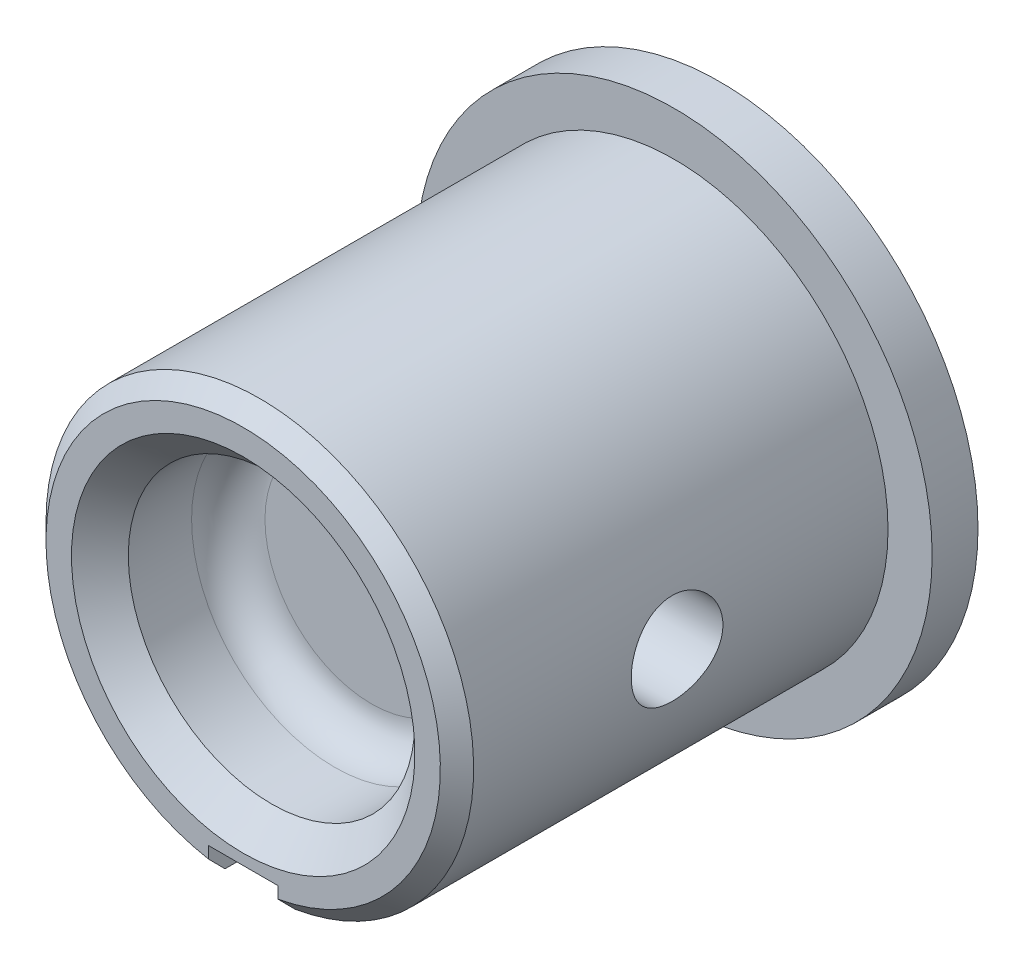
ISO-10303-21;
HEADER;
FILE_DESCRIPTION(('STEP AP214'),'2;1');
FILE_NAME('part.step','',(''),(''),'','','');
FILE_SCHEMA(('AUTOMOTIVE_DESIGN { 1 0 10303 214 1 1 1 1 }'));
ENDSEC;
DATA;
#1=APPLICATION_CONTEXT('core data for automotive mechanical design processes');
#2=APPLICATION_PROTOCOL_DEFINITION('international standard','automotive_design',2000,#1);
#3=PRODUCT_CONTEXT('',#1,'mechanical');
#4=PRODUCT('Part','Part','',(#3));
#5=PRODUCT_RELATED_PRODUCT_CATEGORY('part','',(#4));
#6=PRODUCT_DEFINITION_FORMATION('','',#4);
#7=PRODUCT_DEFINITION_CONTEXT('part definition',#1,'design');
#8=PRODUCT_DEFINITION('design','',#6,#7);
#9=PRODUCT_DEFINITION_SHAPE('','',#8);
#10=(LENGTH_UNIT() NAMED_UNIT(*) SI_UNIT(.MILLI.,.METRE.));
#11=(NAMED_UNIT(*) PLANE_ANGLE_UNIT() SI_UNIT($,.RADIAN.));
#12=(NAMED_UNIT(*) SI_UNIT($,.STERADIAN.) SOLID_ANGLE_UNIT());
#13=UNCERTAINTY_MEASURE_WITH_UNIT(LENGTH_MEASURE(1.E-05),#10,'distance_accuracy_value','');
#14=(GEOMETRIC_REPRESENTATION_CONTEXT(3) GLOBAL_UNCERTAINTY_ASSIGNED_CONTEXT((#13)) GLOBAL_UNIT_ASSIGNED_CONTEXT((#10,
#11,#12)) REPRESENTATION_CONTEXT('',''));
#15=CARTESIAN_POINT('',(0.,0.,0.));
#16=DIRECTION('',(0.,0.,1.));
#17=DIRECTION('',(1.,0.,0.));
#18=AXIS2_PLACEMENT_3D('',#15,#16,#17);
#19=CARTESIAN_POINT('',(0.,0.,8.382));
#20=DIRECTION('',(0.,0.,1.));
#21=DIRECTION('',(1.,0.,0.));
#22=AXIS2_PLACEMENT_3D('',#19,#20,#21);
#23=PLANE('',#22);
#24=CARTESIAN_POINT('',(0.,0.,8.382));
#25=DIRECTION('',(0.,0.,-1.));
#26=DIRECTION('',(1.,0.,0.));
#27=AXIS2_PLACEMENT_3D('',#24,#25,#26);
#28=CIRCLE('',#27,2.95275);
#29=CARTESIAN_POINT('',(2.95275,0.,8.382));
#30=VERTEX_POINT('',#29);
#31=EDGE_CURVE('E104',#30,#30,#28,.F.);
#32=ORIENTED_EDGE('',*,*,#31,.T.);
#33=EDGE_LOOP('',(#32));
#34=FACE_BOUND('',#33,.T.);
#35=ADVANCED_FACE('F16',(#34),#23,.T.);
#36=CARTESIAN_POINT('',(0.,0.,9.398));
#37=DIRECTION('',(0.,0.,-1.));
#38=DIRECTION('',(-1.,0.,0.));
#39=AXIS2_PLACEMENT_3D('',#36,#37,#38);
#40=TOROIDAL_SURFACE('',#39,2.95275,1.016);
#41=CARTESIAN_POINT('',(0.,0.,9.398));
#42=DIRECTION('',(0.,0.,-1.));
#43=DIRECTION('',(-1.,0.,0.));
#44=AXIS2_PLACEMENT_3D('',#41,#42,#43);
#45=CIRCLE('',#44,3.96875);
#46=CARTESIAN_POINT('',(-3.96875,0.,9.398));
#47=VERTEX_POINT('',#46);
#48=EDGE_CURVE('E90',#47,#47,#45,.F.);
#49=ORIENTED_EDGE('',*,*,#48,.T.);
#50=EDGE_LOOP('',(#49));
#51=FACE_BOUND('',#50,.T.);
#52=ORIENTED_EDGE('',*,*,#31,.F.);
#53=EDGE_LOOP('',(#52));
#54=FACE_BOUND('',#53,.T.);
#55=ADVANCED_FACE('F110',(#51,#54),#40,.F.);
#56=CARTESIAN_POINT('',(0.,0.,11.938));
#57=DIRECTION('',(0.,0.,-1.));
#58=DIRECTION('',(-1.,0.,0.));
#59=AXIS2_PLACEMENT_3D('',#56,#57,#58);
#60=CYLINDRICAL_SURFACE('',#59,3.96875);
#61=ORIENTED_EDGE('',*,*,#48,.F.);
#62=EDGE_LOOP('',(#61));
#63=FACE_BOUND('',#62,.T.);
#64=CARTESIAN_POINT('',(0.,0.,11.1506000000645));
#65=DIRECTION('',(0.,0.,1.));
#66=DIRECTION('',(-1.,0.,0.));
#67=AXIS2_PLACEMENT_3D('',#64,#65,#66);
#68=CIRCLE('',#67,3.96875000001273);
#69=CARTESIAN_POINT('',(-3.96875000001273,0.,11.1506000000645));
#70=VERTEX_POINT('',#69);
#71=EDGE_CURVE('E87',#70,#70,#68,.T.);
#72=ORIENTED_EDGE('',*,*,#71,.T.);
#73=EDGE_LOOP('',(#72));
#74=FACE_BOUND('',#73,.T.);
#75=ADVANCED_FACE('F114',(#63,#74),#60,.F.);
#76=CARTESIAN_POINT('',(0.,0.,-1.26999999999999));
#77=DIRECTION('',(0.,0.,-1.));
#78=DIRECTION('',(-1.,0.,0.));
#79=AXIS2_PLACEMENT_3D('',#76,#77,#78);
#80=PLANE('',#79);
#81=CARTESIAN_POINT('',(0.,0.,-1.26999999999999));
#82=DIRECTION('',(0.,0.,-1.));
#83=DIRECTION('',(-1.,0.,0.));
#84=AXIS2_PLACEMENT_3D('',#81,#82,#83);
#85=CIRCLE('',#84,7.14375);
#86=CARTESIAN_POINT('',(-7.14375,0.,-1.26999999999999));
#87=VERTEX_POINT('',#86);
#88=EDGE_CURVE('E191',#87,#87,#85,.F.);
#89=ORIENTED_EDGE('',*,*,#88,.F.);
#90=EDGE_LOOP('',(#89));
#91=FACE_BOUND('',#90,.T.);
#92=ADVANCED_FACE('F240',(#91),#80,.T.);
#93=CARTESIAN_POINT('',(0.,0.,11.9379999999865));
#94=DIRECTION('',(0.,0.,1.));
#95=DIRECTION('',(0.,-1.,0.));
#96=AXIS2_PLACEMENT_3D('',#93,#94,#95);
#97=CONICAL_SURFACE('',#96,4.75614999993468,0.785398163397448);
#98=ORIENTED_EDGE('',*,*,#71,.F.);
#99=EDGE_LOOP('',(#98));
#100=FACE_BOUND('',#99,.T.);
#101=CARTESIAN_POINT('',(0.,0.,11.9379999999865));
#102=DIRECTION('',(0.,0.,1.));
#103=DIRECTION('',(0.,-1.,0.));
#104=AXIS2_PLACEMENT_3D('',#101,#102,#103);
#105=CIRCLE('',#104,4.75614999993468);
#106=CARTESIAN_POINT('',(0.,-4.75614999993468,11.9379999999865));
#107=VERTEX_POINT('',#106);
#108=EDGE_CURVE('E100',#107,#107,#105,.F.);
#109=ORIENTED_EDGE('',*,*,#108,.F.);
#110=EDGE_LOOP('',(#109));
#111=FACE_BOUND('',#110,.T.);
#112=ADVANCED_FACE('F238',(#100,#111),#97,.F.);
#113=CARTESIAN_POINT('',(0.,-5.4864,0.762));
#114=DIRECTION('',(0.,0.,1.));
#115=DIRECTION('',(1.,0.,0.));
#116=AXIS2_PLACEMENT_3D('',#113,#114,#115);
#117=PLANE('',#116);
#118=CARTESIAN_POINT('',(0.,0.,0.762));
#119=DIRECTION('',(0.,0.,-1.));
#120=DIRECTION('',(-1.,0.,0.));
#121=AXIS2_PLACEMENT_3D('',#118,#119,#120);
#122=CIRCLE('',#121,5.92201);
#123=CARTESIAN_POINT('',(-0.965199999999998,-5.84282392342093,0.762));
#124=VERTEX_POINT('',#123);
#125=CARTESIAN_POINT('',(0.965200000000001,-5.84282392342093,0.762));
#126=VERTEX_POINT('',#125);
#127=EDGE_CURVE('E20',#124,#126,#122,.F.);
#128=ORIENTED_EDGE('',*,*,#127,.T.);
#129=DIRECTION('',(0.,1.,0.));
#130=VECTOR('',#129,1.);
#131=CARTESIAN_POINT('',(0.9652,-5.4864,0.762));
#132=LINE('',#131,#130);
#133=CARTESIAN_POINT('',(0.965200000000001,-5.05079,0.762));
#134=VERTEX_POINT('',#133);
#135=EDGE_CURVE('E56',#126,#134,#132,.T.);
#136=ORIENTED_EDGE('',*,*,#135,.T.);
#137=DIRECTION('',(1.,0.,0.));
#138=VECTOR('',#137,1.);
#139=CARTESIAN_POINT('',(-0.9652,-5.05079,0.762000000000001));
#140=LINE('',#139,#138);
#141=CARTESIAN_POINT('',(-0.9652,-5.05079,0.762));
#142=VERTEX_POINT('',#141);
#143=EDGE_CURVE('E85',#134,#142,#140,.F.);
#144=ORIENTED_EDGE('',*,*,#143,.T.);
#145=DIRECTION('',(0.,1.,0.));
#146=VECTOR('',#145,1.);
#147=CARTESIAN_POINT('',(-0.9652,-5.4864,0.762));
#148=LINE('',#147,#146);
#149=EDGE_CURVE('E72',#142,#124,#148,.F.);
#150=ORIENTED_EDGE('',*,*,#149,.T.);
#151=EDGE_LOOP('',(#128,#136,#144,#150));
#152=FACE_BOUND('',#151,.T.);
#153=ADVANCED_FACE('F83',(#152),#117,.T.);
#154=CARTESIAN_POINT('',(0.,0.,-0.634999999999995));
#155=DIRECTION('',(0.,0.,-1.));
#156=DIRECTION('',(-1.,0.,0.));
#157=AXIS2_PLACEMENT_3D('',#154,#155,#156);
#158=CYLINDRICAL_SURFACE('',#157,7.14375);
#159=CARTESIAN_POINT('',(0.,0.,0.));
#160=DIRECTION('',(0.,0.,-1.));
#161=DIRECTION('',(-1.,0.,0.));
#162=AXIS2_PLACEMENT_3D('',#159,#160,#161);
#163=CIRCLE('',#162,7.14375);
#164=CARTESIAN_POINT('',(-7.14375,0.,0.));
#165=VERTEX_POINT('',#164);
#166=EDGE_CURVE('E185',#165,#165,#163,.F.);
#167=ORIENTED_EDGE('',*,*,#166,.F.);
#168=EDGE_LOOP('',(#167));
#169=FACE_BOUND('',#168,.T.);
#170=ORIENTED_EDGE('',*,*,#88,.T.);
#171=EDGE_LOOP('',(#170));
#172=FACE_BOUND('',#171,.T.);
#173=ADVANCED_FACE('F229',(#169,#172),#158,.T.);
#174=CARTESIAN_POINT('',(0.,5.953125,11.938));
#175=DIRECTION('',(0.,0.,1.));
#176=DIRECTION('',(1.,0.,0.));
#177=AXIS2_PLACEMENT_3D('',#174,#175,#176);
#178=PLANE('',#177);
#179=ORIENTED_EDGE('',*,*,#108,.T.);
#180=EDGE_LOOP('',(#179));
#181=FACE_BOUND('',#180,.T.);
#182=DIRECTION('',(0.,1.,0.));
#183=VECTOR('',#182,1.);
#184=CARTESIAN_POINT('',(0.965200000000003,5.953125,11.938));
#185=LINE('',#184,#183);
#186=CARTESIAN_POINT('',(0.965200000000003,-5.05079,11.938));
#187=VERTEX_POINT('',#186);
#188=CARTESIAN_POINT('',(0.965200000000002,-5.37502650786039,11.9379999999932));
#189=VERTEX_POINT('',#188);
#190=EDGE_CURVE('E190',#187,#189,#185,.F.);
#191=ORIENTED_EDGE('',*,*,#190,.T.);
#192=CARTESIAN_POINT('',(0.,0.,11.9379999999865));
#193=DIRECTION('',(0.,0.,-1.));
#194=DIRECTION('',(-1.,0.,0.));
#195=AXIS2_PLACEMENT_3D('',#192,#193,#194);
#196=CIRCLE('',#195,5.46100000002525);
#197=CARTESIAN_POINT('',(-0.9652,-5.37502650786039,11.9379999999932));
#198=VERTEX_POINT('',#197);
#199=EDGE_CURVE('E170',#198,#189,#196,.T.);
#200=ORIENTED_EDGE('',*,*,#199,.F.);
#201=DIRECTION('',(0.,-1.,0.));
#202=VECTOR('',#201,1.);
#203=CARTESIAN_POINT('',(-0.9652,-5.84282392342093,11.938));
#204=LINE('',#203,#202);
#205=CARTESIAN_POINT('',(-0.9652,-5.05079,11.938));
#206=VERTEX_POINT('',#205);
#207=EDGE_CURVE('E188',#198,#206,#204,.F.);
#208=ORIENTED_EDGE('',*,*,#207,.T.);
#209=DIRECTION('',(1.,0.,0.));
#210=VECTOR('',#209,1.);
#211=CARTESIAN_POINT('',(-0.9652,-5.05079,11.938));
#212=LINE('',#211,#210);
#213=EDGE_CURVE('E99',#206,#187,#212,.T.);
#214=ORIENTED_EDGE('',*,*,#213,.T.);
#215=EDGE_LOOP('',(#191,#200,#208,#214));
#216=FACE_BOUND('',#215,.T.);
#217=ADVANCED_FACE('F219',(#181,#216),#178,.T.);
#218=CARTESIAN_POINT('',(-0.9652,-5.05079,11.938));
#219=DIRECTION('',(0.,1.,0.));
#220=DIRECTION('',(0.,0.,1.));
#221=AXIS2_PLACEMENT_3D('',#218,#219,#220);
#222=PLANE('',#221);
#223=DIRECTION('',(0.,0.,1.));
#224=VECTOR('',#223,1.);
#225=CARTESIAN_POINT('',(-0.9652,-5.05079,11.938));
#226=LINE('',#225,#224);
#227=EDGE_CURVE('E184',#206,#142,#226,.F.);
#228=ORIENTED_EDGE('',*,*,#227,.T.);
#229=ORIENTED_EDGE('',*,*,#143,.F.);
#230=DIRECTION('',(0.,0.,1.));
#231=VECTOR('',#230,1.);
#232=CARTESIAN_POINT('',(0.965200000000003,-5.05079,11.938));
#233=LINE('',#232,#231);
#234=EDGE_CURVE('E162',#134,#187,#233,.T.);
#235=ORIENTED_EDGE('',*,*,#234,.T.);
#236=ORIENTED_EDGE('',*,*,#213,.F.);
#237=EDGE_LOOP('',(#228,#229,#235,#236));
#238=FACE_BOUND('',#237,.T.);
#239=ADVANCED_FACE('F221',(#238),#222,.F.);
#240=CARTESIAN_POINT('',(0.,7.14375,0.));
#241=DIRECTION('',(0.,0.,1.));
#242=DIRECTION('',(1.,0.,0.));
#243=AXIS2_PLACEMENT_3D('',#240,#241,#242);
#244=PLANE('',#243);
#245=CARTESIAN_POINT('',(0.,0.,0.));
#246=DIRECTION('',(0.,0.,-1.));
#247=DIRECTION('',(-1.,0.,0.));
#248=AXIS2_PLACEMENT_3D('',#245,#246,#247);
#249=CIRCLE('',#248,5.92201);
#250=CARTESIAN_POINT('',(-5.92201,0.,0.));
#251=VERTEX_POINT('',#250);
#252=EDGE_CURVE('E81',#251,#251,#249,.F.);
#253=ORIENTED_EDGE('',*,*,#252,.F.);
#254=EDGE_LOOP('',(#253));
#255=FACE_BOUND('',#254,.T.);
#256=ORIENTED_EDGE('',*,*,#166,.T.);
#257=EDGE_LOOP('',(#256));
#258=FACE_BOUND('',#257,.T.);
#259=ADVANCED_FACE('F223',(#255,#258),#244,.T.);
#260=CARTESIAN_POINT('',(-0.9652,-5.84282392342093,11.938));
#261=DIRECTION('',(-1.,0.,0.));
#262=DIRECTION('',(0.,-1.,0.));
#263=AXIS2_PLACEMENT_3D('',#260,#261,#262);
#264=PLANE('',#263);
#265=DIRECTION('',(0.,0.,-1.));
#266=VECTOR('',#265,1.);
#267=CARTESIAN_POINT('',(-0.965199999999995,-5.84282392342093,5.969));
#268=LINE('',#267,#266);
#269=CARTESIAN_POINT('',(-0.965199999999998,-5.84282392340875,11.4769900000179));
#270=VERTEX_POINT('',#269);
#271=EDGE_CURVE('E68',#124,#270,#268,.F.);
#272=ORIENTED_EDGE('',*,*,#271,.F.);
#273=ORIENTED_EDGE('',*,*,#149,.F.);
#274=ORIENTED_EDGE('',*,*,#227,.F.);
#275=ORIENTED_EDGE('',*,*,#207,.F.);
#276=CARTESIAN_POINT('',(-0.9652,-5.84282392339656,11.4769900000358));
#277=CARTESIAN_POINT('',(-0.9652,-5.76490383496771,11.5538718263794));
#278=CARTESIAN_POINT('',(-0.9652,-5.6869606729343,11.6307302394076));
#279=CARTESIAN_POINT('',(-0.9652,-5.53102820108882,11.7844002393942));
#280=CARTESIAN_POINT('',(-0.9652,-5.45303889127641,11.8612118263523));
#281=CARTESIAN_POINT('',(-0.9652,-5.3750265078591,11.9379999999945));
#282=B_SPLINE_CURVE_WITH_KNOTS('',3,(#276,#277,#278,#279,#280,#281),.UNSPECIFIED.,.F.,.F.,(4,2,
4),(0.,0.328391792602659,0.656783587604142),.UNSPECIFIED.);
#283=EDGE_CURVE('E79',#270,#198,#282,.T.);
#284=ORIENTED_EDGE('',*,*,#283,.F.);
#285=EDGE_LOOP('',(#272,#273,#274,#275,#284));
#286=FACE_BOUND('',#285,.T.);
#287=ADVANCED_FACE('F75',(#286),#264,.F.);
#288=CARTESIAN_POINT('',(0.,0.,11.4769899999487));
#289=DIRECTION('',(0.,0.,-1.));
#290=DIRECTION('',(-1.,0.,0.));
#291=AXIS2_PLACEMENT_3D('',#288,#289,#290);
#292=CONICAL_SURFACE('',#291,5.92201000006298,0.785398163397448);
#293=CARTESIAN_POINT('',(0.965200000000002,-5.37502650785522,11.9379999999983));
#294=CARTESIAN_POINT('',(0.965200000000002,-5.45303889127521,11.8612118263535));
#295=CARTESIAN_POINT('',(0.965200000000001,-5.5310282010903,11.7844002393927));
#296=CARTESIAN_POINT('',(0.965200000000001,-5.68696067294114,11.6307302394009));
#297=CARTESIAN_POINT('',(0.965200000000001,-5.76490383497723,11.5538718263701));
#298=CARTESIAN_POINT('',(0.9652,-5.84282392340875,11.4769900000237));
#299=B_SPLINE_CURVE_WITH_KNOTS('',3,(#293,#294,#295,#296,#297,#298),.UNSPECIFIED.,.F.,.F.,(4,2,
4),(0.,0.328391795012768,0.656783587626709),.UNSPECIFIED.);
#300=CARTESIAN_POINT('',(0.965200000000002,-5.84282392341484,11.4769900000119));
#301=VERTEX_POINT('',#300);
#302=EDGE_CURVE('E35',#189,#301,#299,.T.);
#303=ORIENTED_EDGE('',*,*,#302,.T.);
#304=CARTESIAN_POINT('',(0.,0.,11.47699));
#305=DIRECTION('',(0.,0.,-1.));
#306=DIRECTION('',(-1.,0.,0.));
#307=AXIS2_PLACEMENT_3D('',#304,#305,#306);
#308=CIRCLE('',#307,5.92201);
#309=EDGE_CURVE('E80',#270,#301,#308,.T.);
#310=ORIENTED_EDGE('',*,*,#309,.F.);
#311=ORIENTED_EDGE('',*,*,#283,.T.);
#312=ORIENTED_EDGE('',*,*,#199,.T.);
#313=EDGE_LOOP('',(#303,#310,#311,#312));
#314=FACE_BOUND('',#313,.T.);
#315=ADVANCED_FACE('F152',(#314),#292,.T.);
#316=CARTESIAN_POINT('',(0.965200000000003,-5.05079,11.938));
#317=DIRECTION('',(1.,0.,0.));
#318=DIRECTION('',(0.,1.,0.));
#319=AXIS2_PLACEMENT_3D('',#316,#317,#318);
#320=PLANE('',#319);
#321=ORIENTED_EDGE('',*,*,#190,.F.);
#322=ORIENTED_EDGE('',*,*,#234,.F.);
#323=ORIENTED_EDGE('',*,*,#135,.F.);
#324=DIRECTION('',(0.,0.,-1.));
#325=VECTOR('',#324,1.);
#326=CARTESIAN_POINT('',(0.965200000000003,-5.84282392342093,5.969));
#327=LINE('',#326,#325);
#328=EDGE_CURVE('E69',#301,#126,#327,.T.);
#329=ORIENTED_EDGE('',*,*,#328,.F.);
#330=ORIENTED_EDGE('',*,*,#302,.F.);
#331=EDGE_LOOP('',(#321,#322,#323,#329,#330));
#332=FACE_BOUND('',#331,.T.);
#333=ADVANCED_FACE('F147',(#332),#320,.F.);
#334=CARTESIAN_POINT('',(0.,0.,5.842));
#335=DIRECTION('',(1.,0.,0.));
#336=DIRECTION('',(0.,0.,-1.));
#337=AXIS2_PLACEMENT_3D('',#334,#335,#336);
#338=CYLINDRICAL_SURFACE('',#337,1.27);
#339=CARTESIAN_POINT('',(5.78422876796034,-1.27,5.842));
#340=CARTESIAN_POINT('',(5.78423019043854,-1.26999753154441,5.91245070838072));
#341=CARTESIAN_POINT('',(5.78552989364852,-1.26411790053725,5.98293141257982));
#342=CARTESIAN_POINT('',(5.79057917663973,-1.24077901258341,6.12189095327402));
#343=CARTESIAN_POINT('',(5.7943305720035,-1.22331117393029,6.19036826687874));
#344=CARTESIAN_POINT('',(5.80383927760964,-1.17736912725354,6.32329075856355));
#345=CARTESIAN_POINT('',(5.80959443490341,-1.14890672879197,6.38774017711405));
#346=CARTESIAN_POINT('',(5.82245961990261,-1.08181697159541,6.51094981315048));
#347=CARTESIAN_POINT('',(5.82956960854718,-1.04318990590358,6.56971019458223));
#348=CARTESIAN_POINT('',(5.84447236616351,-0.956198497594469,6.68082963727089));
#349=CARTESIAN_POINT('',(5.85227358107198,-0.907700352935909,6.73308283498115));
#350=CARTESIAN_POINT('',(5.86760575776913,-0.80263237625998,6.8287781703955));
#351=CARTESIAN_POINT('',(5.87513669901522,-0.746061932313847,6.87221963951254));
#352=CARTESIAN_POINT('',(5.88917156935918,-0.625747449440325,6.94947526697142));
#353=CARTESIAN_POINT('',(5.89566437214772,-0.561936803383417,6.98318788937305));
#354=CARTESIAN_POINT('',(5.90679612290519,-0.429393628697957,7.03937234606026));
#355=CARTESIAN_POINT('',(5.91143527071322,-0.360661631573718,7.06184539212944));
#356=CARTESIAN_POINT('',(5.91827732461187,-0.221327073452878,7.09458060902384));
#357=CARTESIAN_POINT('',(5.92051592380923,-0.150768367063298,7.10502185731505));
#358=CARTESIAN_POINT('',(5.92242822466802,-0.008867647093742,7.11395671127931));
#359=CARTESIAN_POINT('',(5.92210220886384,0.0624742793369878,7.112451633036));
#360=CARTESIAN_POINT('',(5.91894938070722,0.20268273334354,7.09767050837816));
#361=CARTESIAN_POINT('',(5.91616357209747,0.271570664000415,7.08458745408881));
#362=CARTESIAN_POINT('',(5.9084507780475,0.406149950693564,7.04732895961609));
#363=CARTESIAN_POINT('',(5.90352369829368,0.471841165786799,7.02315303083762));
#364=CARTESIAN_POINT('',(5.89201564430516,0.59870151873607,6.96422245140721));
#365=CARTESIAN_POINT('',(5.88542320047035,0.659835323313239,6.92939406999803));
#366=CARTESIAN_POINT('',(5.87130819580074,0.775461384272288,6.85020211284715));
#367=CARTESIAN_POINT('',(5.86378551290536,0.829952767207408,6.80583728522326));
#368=CARTESIAN_POINT('',(5.84846044762657,0.931894431065659,6.70777917393297));
#369=CARTESIAN_POINT('',(5.8406554805794,0.979181983916723,6.6539169774018));
#370=CARTESIAN_POINT('',(5.82578696313064,1.06408267605516,6.53894667757515));
#371=CARTESIAN_POINT('',(5.81872343128937,1.10169557319133,6.47783839297006));
#372=CARTESIAN_POINT('',(5.80613110571408,1.16624772230353,6.34985441621532));
#373=CARTESIAN_POINT('',(5.80060659644426,1.19315726459275,6.28296328953213));
#374=CARTESIAN_POINT('',(5.79177793610174,1.23530533994072,6.145462246658));
#375=CARTESIAN_POINT('',(5.78847344783675,1.25054564545379,6.07485289697442));
#376=CARTESIAN_POINT('',(5.78452746826554,1.2686723986734,5.93340382879526));
#377=CARTESIAN_POINT('',(5.78383500782889,1.27179533072559,5.86259580272412));
#378=CARTESIAN_POINT('',(5.7850541547333,1.26623802655928,5.72147083253194));
#379=CARTESIAN_POINT('',(5.78696559062974,1.25755856742877,5.6511538563858));
#380=CARTESIAN_POINT('',(5.7931291223186,1.2288477376243,5.51382370340442));
#381=CARTESIAN_POINT('',(5.79735453568513,1.2089456980489,5.44678218039867));
#382=CARTESIAN_POINT('',(5.8076460134063,1.15849427403013,5.31698525181255));
#383=CARTESIAN_POINT('',(5.81371224828175,1.12794390316095,5.25423024396496));
#384=CARTESIAN_POINT('',(5.8271144338426,1.05653865754824,5.13376165016051));
#385=CARTESIAN_POINT('',(5.83446789449693,1.01553756325133,5.07613672024115));
#386=CARTESIAN_POINT('',(5.84956937027859,0.924586906015841,4.96849845031591));
#387=CARTESIAN_POINT('',(5.85731743233699,0.874636276896245,4.91848601852086));
#388=CARTESIAN_POINT('',(5.87250250521467,0.766136322872278,4.82657952574814));
#389=CARTESIAN_POINT('',(5.87993149092006,0.707449378607752,4.78484638258287));
#390=CARTESIAN_POINT('',(5.89349567131357,0.583760371144494,4.71183165158195));
#391=CARTESIAN_POINT('',(5.89963092512168,0.518758596714559,4.6805495861225));
#392=CARTESIAN_POINT('',(5.90988242197144,0.384681770381881,4.62955157092733));
#393=CARTESIAN_POINT('',(5.91401113744788,0.315634950410999,4.60976401825449));
#394=CARTESIAN_POINT('',(5.91983819193874,0.17509900142468,4.58209228826361));
#395=CARTESIAN_POINT('',(5.92153686987843,0.103610214422694,4.57420645096603));
#396=CARTESIAN_POINT('',(5.9223028730066,-0.0382505685620238,4.57063421322773));
#397=CARTESIAN_POINT('',(5.92142210418266,-0.108616333110905,4.57470717122595));
#398=CARTESIAN_POINT('',(5.91723889748306,-0.247635611723433,4.59440027603786));
#399=CARTESIAN_POINT('',(5.91393649990504,-0.316289154260025,4.61002023070127));
#400=CARTESIAN_POINT('',(5.90528438236595,-0.44975752265976,4.65225052622921));
#401=CARTESIAN_POINT('',(5.89994079680882,-0.514583184958089,4.67882795527935));
#402=CARTESIAN_POINT('',(5.88777801268395,-0.638887677684315,4.74218619207701));
#403=CARTESIAN_POINT('',(5.88095867694329,-0.698366010343019,4.77896794841973));
#404=CARTESIAN_POINT('',(5.86643341213001,-0.811465136844986,4.86248179900502));
#405=CARTESIAN_POINT('',(5.85871353043912,-0.864958671566012,4.90938382447386));
#406=CARTESIAN_POINT('',(5.84333417709668,-0.963398299582785,5.01146252756262));
#407=CARTESIAN_POINT('',(5.83567472038098,-1.00834233937704,5.06664118746798));
#408=CARTESIAN_POINT('',(5.82117496820221,-1.08895723139193,5.18455200743988));
#409=CARTESIAN_POINT('',(5.81434635420928,-1.12450262617828,5.24737145632032));
#410=CARTESIAN_POINT('',(5.80242727331533,-1.18447556110445,5.37822420544932));
#411=CARTESIAN_POINT('',(5.7973353111475,-1.20891267160341,5.44625295833588));
#412=CARTESIAN_POINT('',(5.79042532915277,-1.24152327444963,5.56897652136881));
#413=CARTESIAN_POINT('',(5.78811679633005,-1.25218189692961,5.62299711227898));
#414=CARTESIAN_POINT('',(5.7850179946247,-1.26642106387641,5.73200573599247));
#415=CARTESIAN_POINT('',(5.78422765732244,-1.27000192731273,5.78699372508589));
#416=CARTESIAN_POINT('',(5.78422876796034,-1.27,5.842));
#417=B_SPLINE_CURVE_WITH_KNOTS('',3,(#339,#340,#341,#342,#343,#344,#345,#346,#347,#348,#349,
#350,#351,#352,#353,#354,#355,#356,#357,#358,#359,#360,#361,#362,#363,#364,#365,#366,#367,#368,
#369,#370,#371,#372,#373,#374,#375,#376,#377,#378,#379,#380,#381,#382,#383,#384,#385,#386,#387,
#388,#389,#390,#391,#392,#393,#394,#395,#396,#397,#398,#399,#400,#401,#402,#403,#404,#405,#406,
#407,#408,#409,#410,#411,#412,#413,#414,#415,#416),.UNSPECIFIED.,.T.,.F.,(4,2,2,2,2,2,2,2,2,2,2,
2,2,2,2,2,2,2,2,2,2,2,2,2,2,2,2,2,2,2,2,2,2,2,2,2,2,2,4),(0.,0.211150577326392,
0.422457698107549,0.633538476356163,0.84461316989931,1.0587664048275,1.27293588248979,
1.48926579354851,1.70557237618521,1.91861615563496,2.131636465147,2.34117146950145,
2.55071570388959,2.76174443793512,2.97280089138693,3.18808097961901,3.40336645566692,
3.61924540550569,3.83509155872463,4.04670339197906,4.25830129305226,4.46750912330726,
4.67673633902923,4.8890691253705,5.10142722430077,5.31757741205463,5.53371772019594,
5.74849677015111,5.96324586124965,6.17370345521214,6.38415754708884,6.5939840727429,
6.80383011042949,7.0175201815673,7.231261514252,7.44772636830316,7.66400437160758,
7.82887326272725,7.99373472362161),.UNSPECIFIED.);
#418=CARTESIAN_POINT('',(5.78422876796034,-1.27,5.842));
#419=VERTEX_POINT('',#418);
#420=EDGE_CURVE('E26',#419,#419,#417,.T.);
#421=ORIENTED_EDGE('',*,*,#420,.F.);
#422=EDGE_LOOP('',(#421));
#423=FACE_BOUND('',#422,.T.);
#424=CARTESIAN_POINT('',(-5.78422876796034,-1.27,5.842));
#425=CARTESIAN_POINT('',(-5.78423019043854,-1.26999753154441,5.77154929161928));
#426=CARTESIAN_POINT('',(-5.78552989364852,-1.26411790053725,5.70106858742018));
#427=CARTESIAN_POINT('',(-5.79057917663973,-1.24077901258341,5.56210904672598));
#428=CARTESIAN_POINT('',(-5.7943305720035,-1.22331117393029,5.49363173312126));
#429=CARTESIAN_POINT('',(-5.80383927760964,-1.17736912725354,5.36070924143645));
#430=CARTESIAN_POINT('',(-5.80959443490341,-1.14890672879197,5.29625982288595));
#431=CARTESIAN_POINT('',(-5.82245961990261,-1.08181697159541,5.17305018684952));
#432=CARTESIAN_POINT('',(-5.82956960854718,-1.04318990590358,5.11428980541777));
#433=CARTESIAN_POINT('',(-5.84447236616351,-0.956198497594468,5.00317036272911));
#434=CARTESIAN_POINT('',(-5.85227358107198,-0.907700352935908,4.95091716501884));
#435=CARTESIAN_POINT('',(-5.86760575776913,-0.802632376259979,4.8552218296045));
#436=CARTESIAN_POINT('',(-5.87513669901522,-0.746061932313847,4.81178036048746));
#437=CARTESIAN_POINT('',(-5.88917156935918,-0.625747449440325,4.73452473302858));
#438=CARTESIAN_POINT('',(-5.89566437214772,-0.561936803383416,4.70081211062695));
#439=CARTESIAN_POINT('',(-5.90679612290519,-0.429393628697957,4.64462765393974));
#440=CARTESIAN_POINT('',(-5.91143527071322,-0.360661631573718,4.62215460787056));
#441=CARTESIAN_POINT('',(-5.91827732461187,-0.221327073452878,4.58941939097616));
#442=CARTESIAN_POINT('',(-5.92051592380923,-0.150768367063298,4.57897814268495));
#443=CARTESIAN_POINT('',(-5.92242822466802,-0.00886764709374202,4.57004328872069));
#444=CARTESIAN_POINT('',(-5.92210220886384,0.0624742793369878,4.57154836696401));
#445=CARTESIAN_POINT('',(-5.91894938070722,0.202682733343539,4.58632949162184));
#446=CARTESIAN_POINT('',(-5.91616357209747,0.271570664000414,4.59941254591119));
#447=CARTESIAN_POINT('',(-5.9084507780475,0.406149950693564,4.63667104038391));
#448=CARTESIAN_POINT('',(-5.90352369829368,0.471841165786799,4.66084696916238));
#449=CARTESIAN_POINT('',(-5.89201564430516,0.59870151873607,4.71977754859279));
#450=CARTESIAN_POINT('',(-5.88542320047035,0.659835323313239,4.75460593000197));
#451=CARTESIAN_POINT('',(-5.87130819580074,0.775461384272288,4.83379788715285));
#452=CARTESIAN_POINT('',(-5.86378551290536,0.829952767207408,4.87816271477674));
#453=CARTESIAN_POINT('',(-5.84846044762657,0.931894431065659,4.97622082606703));
#454=CARTESIAN_POINT('',(-5.8406554805794,0.979181983916723,5.0300830225982));
#455=CARTESIAN_POINT('',(-5.82578696313064,1.06408267605516,5.14505332242485));
#456=CARTESIAN_POINT('',(-5.81872343128937,1.10169557319133,5.20616160702994));
#457=CARTESIAN_POINT('',(-5.80613110571408,1.16624772230353,5.33414558378468));
#458=CARTESIAN_POINT('',(-5.80060659644426,1.19315726459275,5.40103671046787));
#459=CARTESIAN_POINT('',(-5.79177793610174,1.23530533994072,5.538537753342));
#460=CARTESIAN_POINT('',(-5.78847344783675,1.25054564545379,5.60914710302558));
#461=CARTESIAN_POINT('',(-5.78452746826554,1.2686723986734,5.75059617120474));
#462=CARTESIAN_POINT('',(-5.78383500782889,1.27179533072559,5.82140419727588));
#463=CARTESIAN_POINT('',(-5.7850541547333,1.26623802655928,5.96252916746806));
#464=CARTESIAN_POINT('',(-5.78696559062974,1.25755856742877,6.0328461436142));
#465=CARTESIAN_POINT('',(-5.7931291223186,1.2288477376243,6.17017629659558));
#466=CARTESIAN_POINT('',(-5.79735453568513,1.2089456980489,6.23721781960133));
#467=CARTESIAN_POINT('',(-5.8076460134063,1.15849427403013,6.36701474818745));
#468=CARTESIAN_POINT('',(-5.81371224828175,1.12794390316095,6.42976975603504));
#469=CARTESIAN_POINT('',(-5.8271144338426,1.05653865754824,6.55023834983949));
#470=CARTESIAN_POINT('',(-5.83446789449693,1.01553756325133,6.60786327975885));
#471=CARTESIAN_POINT('',(-5.84956937027859,0.924586906015841,6.71550154968409));
#472=CARTESIAN_POINT('',(-5.85731743233699,0.874636276896245,6.76551398147914));
#473=CARTESIAN_POINT('',(-5.87250250521467,0.766136322872278,6.85742047425186));
#474=CARTESIAN_POINT('',(-5.87993149092006,0.707449378607752,6.89915361741713));
#475=CARTESIAN_POINT('',(-5.89349567131357,0.583760371144494,6.97216834841805));
#476=CARTESIAN_POINT('',(-5.89963092512168,0.518758596714559,7.0034504138775));
#477=CARTESIAN_POINT('',(-5.90988242197144,0.384681770381881,7.05444842907267));
#478=CARTESIAN_POINT('',(-5.91401113744788,0.315634950410999,7.07423598174551));
#479=CARTESIAN_POINT('',(-5.91983819193874,0.17509900142468,7.10190771173639));
#480=CARTESIAN_POINT('',(-5.92153686987843,0.103610214422694,7.10979354903397));
#481=CARTESIAN_POINT('',(-5.9223028730066,-0.0382505685620238,7.11336578677227));
#482=CARTESIAN_POINT('',(-5.92142210418266,-0.108616333110905,7.10929282877405));
#483=CARTESIAN_POINT('',(-5.91723889748306,-0.247635611723433,7.08959972396214));
#484=CARTESIAN_POINT('',(-5.91393649990504,-0.316289154260025,7.07397976929873));
#485=CARTESIAN_POINT('',(-5.90528438236595,-0.44975752265976,7.03174947377079));
#486=CARTESIAN_POINT('',(-5.89994079680882,-0.514583184958089,7.00517204472065));
#487=CARTESIAN_POINT('',(-5.88777801268395,-0.638887677684315,6.94181380792299));
#488=CARTESIAN_POINT('',(-5.88095867694329,-0.698366010343019,6.90503205158027));
#489=CARTESIAN_POINT('',(-5.86643341213001,-0.811465136844986,6.82151820099498));
#490=CARTESIAN_POINT('',(-5.85871353043912,-0.864958671566012,6.77461617552614));
#491=CARTESIAN_POINT('',(-5.84333417709668,-0.963398299582785,6.67253747243738));
#492=CARTESIAN_POINT('',(-5.83567472038098,-1.00834233937704,6.61735881253202));
#493=CARTESIAN_POINT('',(-5.82117496820221,-1.08895723139193,6.49944799256012));
#494=CARTESIAN_POINT('',(-5.81434635420928,-1.12450262617828,6.43662854367968));
#495=CARTESIAN_POINT('',(-5.80242727331533,-1.18447556110445,6.30577579455068));
#496=CARTESIAN_POINT('',(-5.7973353111475,-1.20891267160341,6.23774704166412));
#497=CARTESIAN_POINT('',(-5.79042532915277,-1.24152327444963,6.11502347863119));
#498=CARTESIAN_POINT('',(-5.78811679633005,-1.25218189692961,6.06100288772102));
#499=CARTESIAN_POINT('',(-5.7850179946247,-1.26642106387641,5.95199426400753));
#500=CARTESIAN_POINT('',(-5.78422765732244,-1.27000192731273,5.89700627491411));
#501=CARTESIAN_POINT('',(-5.78422876796034,-1.27,5.842));
#502=B_SPLINE_CURVE_WITH_KNOTS('',3,(#424,#425,#426,#427,#428,#429,#430,#431,#432,#433,#434,
#435,#436,#437,#438,#439,#440,#441,#442,#443,#444,#445,#446,#447,#448,#449,#450,#451,#452,#453,
#454,#455,#456,#457,#458,#459,#460,#461,#462,#463,#464,#465,#466,#467,#468,#469,#470,#471,#472,
#473,#474,#475,#476,#477,#478,#479,#480,#481,#482,#483,#484,#485,#486,#487,#488,#489,#490,#491,
#492,#493,#494,#495,#496,#497,#498,#499,#500,#501),.UNSPECIFIED.,.T.,.F.,(4,2,2,2,2,2,2,2,2,2,2,
2,2,2,2,2,2,2,2,2,2,2,2,2,2,2,2,2,2,2,2,2,2,2,2,2,2,2,4),(0.,0.211150577326392,
0.422457698107549,0.633538476356163,0.84461316989931,1.0587664048275,1.27293588248979,
1.48926579354851,1.70557237618521,1.91861615563496,2.131636465147,2.34117146950145,
2.55071570388959,2.76174443793512,2.97280089138693,3.18808097961901,3.40336645566692,
3.61924540550569,3.83509155872463,4.04670339197906,4.25830129305226,4.46750912330726,
4.67673633902922,4.88906912537049,5.10142722430077,5.31757741205463,5.53371772019594,
5.74849677015111,5.96324586124965,6.17370345521213,6.38415754708884,6.5939840727429,
6.80383011042949,7.0175201815673,7.231261514252,7.44772636830316,7.66400437160758,
7.82887326272725,7.99373472362161),.UNSPECIFIED.);
#503=CARTESIAN_POINT('',(-5.78422876796034,-1.27,5.842));
#504=VERTEX_POINT('',#503);
#505=EDGE_CURVE('E11',#504,#504,#502,.T.);
#506=ORIENTED_EDGE('',*,*,#505,.F.);
#507=EDGE_LOOP('',(#506));
#508=FACE_BOUND('',#507,.T.);
#509=ADVANCED_FACE('F137',(#423,#508),#338,.F.);
#510=CARTESIAN_POINT('',(0.,0.,5.969));
#511=DIRECTION('',(0.,0.,-1.));
#512=DIRECTION('',(-1.,0.,0.));
#513=AXIS2_PLACEMENT_3D('',#510,#511,#512);
#514=CYLINDRICAL_SURFACE('',#513,5.92201);
#515=ORIENTED_EDGE('',*,*,#127,.F.);
#516=ORIENTED_EDGE('',*,*,#271,.T.);
#517=ORIENTED_EDGE('',*,*,#309,.T.);
#518=ORIENTED_EDGE('',*,*,#328,.T.);
#519=EDGE_LOOP('',(#515,#516,#517,#518));
#520=FACE_BOUND('',#519,.T.);
#521=ORIENTED_EDGE('',*,*,#505,.T.);
#522=EDGE_LOOP('',(#521));
#523=FACE_BOUND('',#522,.T.);
#524=ORIENTED_EDGE('',*,*,#420,.T.);
#525=EDGE_LOOP('',(#524));
#526=FACE_BOUND('',#525,.T.);
#527=ORIENTED_EDGE('',*,*,#252,.T.);
#528=EDGE_LOOP('',(#527));
#529=FACE_BOUND('',#528,.T.);
#530=ADVANCED_FACE('F65',(#520,#523,#526,#529),#514,.T.);
#531=CLOSED_SHELL('',(#35,#55,#75,#92,#112,#153,#173,#217,#239,#259,#287,#315,#333,#509,#530));
#532=MANIFOLD_SOLID_BREP('B1',#531);
#533=ADVANCED_BREP_SHAPE_REPRESENTATION('',(#18,#532),#14);
#534=SHAPE_DEFINITION_REPRESENTATION(#9,#533);
ENDSEC;
END-ISO-10303-21;
